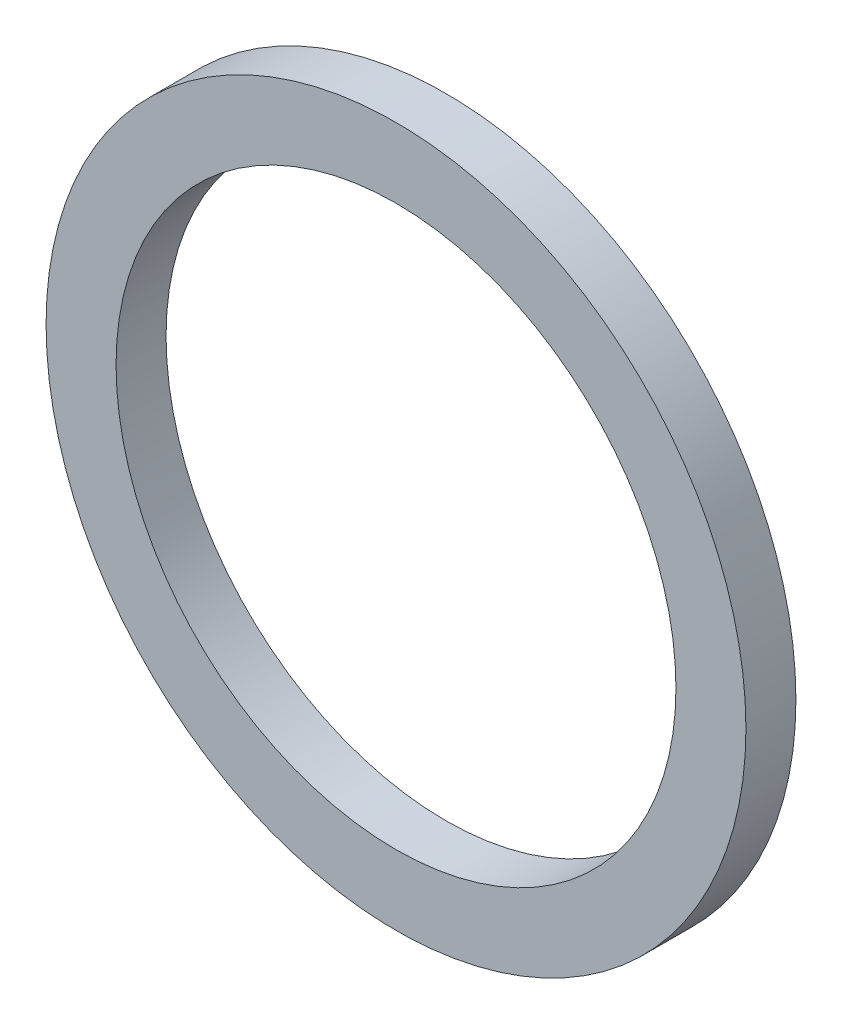
ISO-10303-21;
HEADER;
FILE_DESCRIPTION(('STEP AP214'),'2;1');
FILE_NAME('part.step','',(''),(''),'','','');
FILE_SCHEMA(('AUTOMOTIVE_DESIGN { 1 0 10303 214 1 1 1 1 }'));
ENDSEC;
DATA;
#1=APPLICATION_CONTEXT('core data for automotive mechanical design processes');
#2=APPLICATION_PROTOCOL_DEFINITION('international standard','automotive_design',2000,#1);
#3=PRODUCT_CONTEXT('',#1,'mechanical');
#4=PRODUCT('Part','Part','',(#3));
#5=PRODUCT_RELATED_PRODUCT_CATEGORY('part','',(#4));
#6=PRODUCT_DEFINITION_FORMATION('','',#4);
#7=PRODUCT_DEFINITION_CONTEXT('part definition',#1,'design');
#8=PRODUCT_DEFINITION('design','',#6,#7);
#9=PRODUCT_DEFINITION_SHAPE('','',#8);
#10=(LENGTH_UNIT() NAMED_UNIT(*) SI_UNIT(.MILLI.,.METRE.));
#11=(NAMED_UNIT(*) PLANE_ANGLE_UNIT() SI_UNIT($,.RADIAN.));
#12=(NAMED_UNIT(*) SI_UNIT($,.STERADIAN.) SOLID_ANGLE_UNIT());
#13=UNCERTAINTY_MEASURE_WITH_UNIT(LENGTH_MEASURE(1.E-05),#10,'distance_accuracy_value','');
#14=(GEOMETRIC_REPRESENTATION_CONTEXT(3) GLOBAL_UNCERTAINTY_ASSIGNED_CONTEXT((#13)) GLOBAL_UNIT_ASSIGNED_CONTEXT((#10,
#11,#12)) REPRESENTATION_CONTEXT('',''));
#15=CARTESIAN_POINT('',(0.,0.,0.));
#16=DIRECTION('',(0.,0.,1.));
#17=DIRECTION('',(1.,0.,0.));
#18=AXIS2_PLACEMENT_3D('',#15,#16,#17);
#19=CARTESIAN_POINT('',(0.,0.,1.));
#20=DIRECTION('',(0.,0.,1.));
#21=DIRECTION('',(1.,0.,0.));
#22=AXIS2_PLACEMENT_3D('',#19,#20,#21);
#23=PLANE('',#22);
#24=CARTESIAN_POINT('',(0.,0.,1.));
#25=DIRECTION('',(0.,0.,1.));
#26=DIRECTION('',(1.,0.,0.));
#27=AXIS2_PLACEMENT_3D('',#24,#25,#26);
#28=CIRCLE('',#27,7.);
#29=CARTESIAN_POINT('',(7.,0.,1.));
#30=VERTEX_POINT('',#29);
#31=EDGE_CURVE('E10',#30,#30,#28,.T.);
#32=ORIENTED_EDGE('',*,*,#31,.T.);
#33=EDGE_LOOP('',(#32));
#34=FACE_BOUND('',#33,.T.);
#35=CARTESIAN_POINT('',(0.,0.,1.));
#36=DIRECTION('',(0.,0.,1.));
#37=DIRECTION('',(1.,0.,0.));
#38=AXIS2_PLACEMENT_3D('',#35,#36,#37);
#39=CIRCLE('',#38,5.6);
#40=CARTESIAN_POINT('',(5.6,0.,1.));
#41=VERTEX_POINT('',#40);
#42=EDGE_CURVE('E50',#41,#41,#39,.T.);
#43=ORIENTED_EDGE('',*,*,#42,.F.);
#44=EDGE_LOOP('',(#43));
#45=FACE_BOUND('',#44,.T.);
#46=ADVANCED_FACE('F37',(#34,#45),#23,.T.);
#47=CARTESIAN_POINT('',(0.,0.,0.));
#48=DIRECTION('',(0.,0.,1.));
#49=DIRECTION('',(1.,0.,0.));
#50=AXIS2_PLACEMENT_3D('',#47,#48,#49);
#51=PLANE('',#50);
#52=CARTESIAN_POINT('',(0.,0.,0.));
#53=DIRECTION('',(0.,0.,1.));
#54=DIRECTION('',(1.,0.,0.));
#55=AXIS2_PLACEMENT_3D('',#52,#53,#54);
#56=CIRCLE('',#55,7.);
#57=CARTESIAN_POINT('',(7.,0.,0.));
#58=VERTEX_POINT('',#57);
#59=EDGE_CURVE('E41',#58,#58,#56,.T.);
#60=ORIENTED_EDGE('',*,*,#59,.F.);
#61=EDGE_LOOP('',(#60));
#62=FACE_BOUND('',#61,.T.);
#63=CARTESIAN_POINT('',(0.,0.,0.));
#64=DIRECTION('',(0.,0.,1.));
#65=DIRECTION('',(1.,0.,0.));
#66=AXIS2_PLACEMENT_3D('',#63,#64,#65);
#67=CIRCLE('',#66,5.6);
#68=CARTESIAN_POINT('',(5.6,0.,0.));
#69=VERTEX_POINT('',#68);
#70=EDGE_CURVE('E52',#69,#69,#67,.T.);
#71=ORIENTED_EDGE('',*,*,#70,.T.);
#72=EDGE_LOOP('',(#71));
#73=FACE_BOUND('',#72,.T.);
#74=ADVANCED_FACE('F64',(#62,#73),#51,.F.);
#75=CARTESIAN_POINT('',(0.,0.,1.));
#76=DIRECTION('',(0.,0.,-1.));
#77=DIRECTION('',(-1.,0.,0.));
#78=AXIS2_PLACEMENT_3D('',#75,#76,#77);
#79=CYLINDRICAL_SURFACE('',#78,7.);
#80=ORIENTED_EDGE('',*,*,#31,.F.);
#81=EDGE_LOOP('',(#80));
#82=FACE_BOUND('',#81,.T.);
#83=ORIENTED_EDGE('',*,*,#59,.T.);
#84=EDGE_LOOP('',(#83));
#85=FACE_BOUND('',#84,.T.);
#86=ADVANCED_FACE('F39',(#82,#85),#79,.T.);
#87=CARTESIAN_POINT('',(0.,0.,1.));
#88=DIRECTION('',(0.,0.,-1.));
#89=DIRECTION('',(-1.,0.,0.));
#90=AXIS2_PLACEMENT_3D('',#87,#88,#89);
#91=CYLINDRICAL_SURFACE('',#90,5.6);
#92=ORIENTED_EDGE('',*,*,#42,.T.);
#93=EDGE_LOOP('',(#92));
#94=FACE_BOUND('',#93,.T.);
#95=ORIENTED_EDGE('',*,*,#70,.F.);
#96=EDGE_LOOP('',(#95));
#97=FACE_BOUND('',#96,.T.);
#98=ADVANCED_FACE('F60',(#94,#97),#91,.F.);
#99=CLOSED_SHELL('',(#46,#74,#86,#98));
#100=MANIFOLD_SOLID_BREP('B2',#99);
#101=ADVANCED_BREP_SHAPE_REPRESENTATION('',(#18,#100),#14);
#102=SHAPE_DEFINITION_REPRESENTATION(#9,#101);
ENDSEC;
END-ISO-10303-21;
